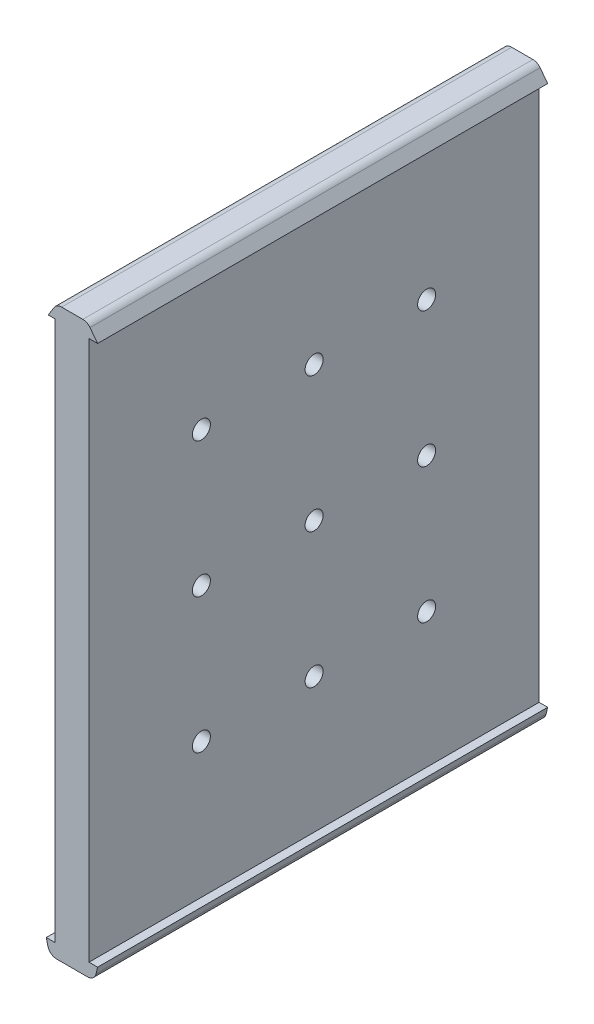
ISO-10303-21;
HEADER;
FILE_DESCRIPTION(('STEP AP214'),'2;1');
FILE_NAME('part.step','',(''),(''),'','','');
FILE_SCHEMA(('AUTOMOTIVE_DESIGN { 1 0 10303 214 1 1 1 1 }'));
ENDSEC;
DATA;
#1=APPLICATION_CONTEXT('core data for automotive mechanical design processes');
#2=APPLICATION_PROTOCOL_DEFINITION('international standard','automotive_design',2000,#1);
#3=PRODUCT_CONTEXT('',#1,'mechanical');
#4=PRODUCT('Part','Part','',(#3));
#5=PRODUCT_RELATED_PRODUCT_CATEGORY('part','',(#4));
#6=PRODUCT_DEFINITION_FORMATION('','',#4);
#7=PRODUCT_DEFINITION_CONTEXT('part definition',#1,'design');
#8=PRODUCT_DEFINITION('design','',#6,#7);
#9=PRODUCT_DEFINITION_SHAPE('','',#8);
#10=(LENGTH_UNIT() NAMED_UNIT(*) SI_UNIT(.MILLI.,.METRE.));
#11=(NAMED_UNIT(*) PLANE_ANGLE_UNIT() SI_UNIT($,.RADIAN.));
#12=(NAMED_UNIT(*) SI_UNIT($,.STERADIAN.) SOLID_ANGLE_UNIT());
#13=UNCERTAINTY_MEASURE_WITH_UNIT(LENGTH_MEASURE(1.E-05),#10,'distance_accuracy_value','');
#14=(GEOMETRIC_REPRESENTATION_CONTEXT(3) GLOBAL_UNCERTAINTY_ASSIGNED_CONTEXT((#13)) GLOBAL_UNIT_ASSIGNED_CONTEXT((#10,
#11,#12)) REPRESENTATION_CONTEXT('',''));
#15=CARTESIAN_POINT('',(0.,0.,0.));
#16=DIRECTION('',(0.,0.,1.));
#17=DIRECTION('',(1.,0.,0.));
#18=AXIS2_PLACEMENT_3D('',#15,#16,#17);
#19=CARTESIAN_POINT('',(-7.17106379094956E-13,-98.178624658982,160.));
#20=DIRECTION('',(0.,1.,0.));
#21=DIRECTION('',(-1.,0.,0.));
#22=AXIS2_PLACEMENT_3D('',#19,#20,#21);
#23=PLANE('',#22);
#24=DIRECTION('',(1.,0.,0.));
#25=VECTOR('',#24,1.);
#26=CARTESIAN_POINT('',(-7.17106379094956E-13,-98.178624658982,30.));
#27=LINE('',#26,#25);
#28=CARTESIAN_POINT('',(-5.69999999999999,-98.178624658982,30.));
#29=VERTEX_POINT('',#28);
#30=CARTESIAN_POINT('',(-3.79999999999998,-98.178624658982,30.));
#31=VERTEX_POINT('',#30);
#32=EDGE_CURVE('E241',#29,#31,#27,.T.);
#33=ORIENTED_EDGE('',*,*,#32,.F.);
#34=DIRECTION('',(0.,0.,-1.));
#35=VECTOR('',#34,1.);
#36=CARTESIAN_POINT('',(-5.69999999999999,-98.178624658982,160.));
#37=LINE('',#36,#35);
#38=CARTESIAN_POINT('',(-5.69999999999999,-98.178624658982,130.));
#39=VERTEX_POINT('',#38);
#40=EDGE_CURVE('E208',#39,#29,#37,.T.);
#41=ORIENTED_EDGE('',*,*,#40,.F.);
#42=DIRECTION('',(-1.,0.,0.));
#43=VECTOR('',#42,1.);
#44=CARTESIAN_POINT('',(-7.17106379094956E-13,-98.178624658982,130.));
#45=LINE('',#44,#43);
#46=CARTESIAN_POINT('',(-3.8,-98.178624658982,130.));
#47=VERTEX_POINT('',#46);
#48=EDGE_CURVE('E260',#47,#39,#45,.T.);
#49=ORIENTED_EDGE('',*,*,#48,.F.);
#50=DIRECTION('',(0.,0.,-1.));
#51=VECTOR('',#50,1.);
#52=CARTESIAN_POINT('',(-3.79999999999998,-98.178624658982,160.));
#53=LINE('',#52,#51);
#54=EDGE_CURVE('E203',#47,#31,#53,.T.);
#55=ORIENTED_EDGE('',*,*,#54,.T.);
#56=EDGE_LOOP('',(#33,#41,#49,#55));
#57=FACE_BOUND('',#56,.T.);
#58=ADVANCED_FACE('F45',(#57),#23,.T.);
#59=CARTESIAN_POINT('',(0.,21.821375341018,160.));
#60=DIRECTION('',(0.,-1.,0.));
#61=DIRECTION('',(0.,0.,-1.));
#62=AXIS2_PLACEMENT_3D('',#59,#60,#61);
#63=PLANE('',#62);
#64=DIRECTION('',(-1.,0.,0.));
#65=VECTOR('',#64,1.);
#66=CARTESIAN_POINT('',(0.,21.821375341018,30.));
#67=LINE('',#66,#65);
#68=CARTESIAN_POINT('',(5.70000000000001,21.821375341018,30.));
#69=VERTEX_POINT('',#68);
#70=CARTESIAN_POINT('',(3.8,21.821375341018,30.));
#71=VERTEX_POINT('',#70);
#72=EDGE_CURVE('E383',#69,#71,#67,.T.);
#73=ORIENTED_EDGE('',*,*,#72,.F.);
#74=DIRECTION('',(0.,0.,-1.));
#75=VECTOR('',#74,1.);
#76=CARTESIAN_POINT('',(5.70000000000001,21.821375341018,160.));
#77=LINE('',#76,#75);
#78=CARTESIAN_POINT('',(5.70000000000001,21.821375341018,130.));
#79=VERTEX_POINT('',#78);
#80=EDGE_CURVE('E185',#79,#69,#77,.T.);
#81=ORIENTED_EDGE('',*,*,#80,.F.);
#82=DIRECTION('',(1.,0.,0.));
#83=VECTOR('',#82,1.);
#84=CARTESIAN_POINT('',(0.,21.821375341018,130.));
#85=LINE('',#84,#83);
#86=CARTESIAN_POINT('',(3.8,21.821375341018,130.));
#87=VERTEX_POINT('',#86);
#88=EDGE_CURVE('E266',#87,#79,#85,.T.);
#89=ORIENTED_EDGE('',*,*,#88,.F.);
#90=DIRECTION('',(0.,0.,-1.));
#91=VECTOR('',#90,1.);
#92=CARTESIAN_POINT('',(3.8,21.821375341018,160.));
#93=LINE('',#92,#91);
#94=EDGE_CURVE('E188',#87,#71,#93,.T.);
#95=ORIENTED_EDGE('',*,*,#94,.T.);
#96=EDGE_LOOP('',(#73,#81,#89,#95));
#97=FACE_BOUND('',#96,.T.);
#98=ADVANCED_FACE('F381',(#97),#63,.T.);
#99=CARTESIAN_POINT('',(-3.8,0.,160.));
#100=DIRECTION('',(-1.,0.,0.));
#101=DIRECTION('',(0.,-1.,0.));
#102=AXIS2_PLACEMENT_3D('',#99,#100,#101);
#103=PLANE('',#102);
#104=CARTESIAN_POINT('',(-3.79999999999999,-38.178624658982,105.042568922673));
#105=DIRECTION('',(-1.,0.,0.));
#106=DIRECTION('',(0.,-1.,0.));
#107=AXIS2_PLACEMENT_3D('',#104,#105,#106);
#108=CIRCLE('',#107,2.);
#109=CARTESIAN_POINT('',(-3.79999999999999,-40.178624658982,105.042568922673));
#110=VERTEX_POINT('',#109);
#111=EDGE_CURVE('E284',#110,#110,#108,.F.);
#112=ORIENTED_EDGE('',*,*,#111,.T.);
#113=EDGE_LOOP('',(#112));
#114=FACE_BOUND('',#113,.T.);
#115=CARTESIAN_POINT('',(-3.79999999999999,-8.17862465898205,55.));
#116=DIRECTION('',(-1.,0.,0.));
#117=DIRECTION('',(0.,-1.,0.));
#118=AXIS2_PLACEMENT_3D('',#115,#116,#117);
#119=CIRCLE('',#118,2.);
#120=CARTESIAN_POINT('',(-3.79999999999999,-10.178624658982,55.));
#121=VERTEX_POINT('',#120);
#122=EDGE_CURVE('E296',#121,#121,#119,.F.);
#123=ORIENTED_EDGE('',*,*,#122,.T.);
#124=EDGE_LOOP('',(#123));
#125=FACE_BOUND('',#124,.T.);
#126=CARTESIAN_POINT('',(-3.79999999999999,-68.178624658982,55.));
#127=DIRECTION('',(-1.,0.,0.));
#128=DIRECTION('',(0.,-1.,0.));
#129=AXIS2_PLACEMENT_3D('',#126,#127,#128);
#130=CIRCLE('',#129,2.);
#131=CARTESIAN_POINT('',(-3.79999999999999,-70.178624658982,55.));
#132=VERTEX_POINT('',#131);
#133=EDGE_CURVE('E308',#132,#132,#130,.F.);
#134=ORIENTED_EDGE('',*,*,#133,.T.);
#135=EDGE_LOOP('',(#134));
#136=FACE_BOUND('',#135,.T.);
#137=CARTESIAN_POINT('',(-3.79999999999999,-8.17862465898205,80.));
#138=DIRECTION('',(-1.,0.,0.));
#139=DIRECTION('',(0.,-1.,0.));
#140=AXIS2_PLACEMENT_3D('',#137,#138,#139);
#141=CIRCLE('',#140,2.);
#142=CARTESIAN_POINT('',(-3.79999999999999,-10.178624658982,80.));
#143=VERTEX_POINT('',#142);
#144=EDGE_CURVE('E320',#143,#143,#141,.F.);
#145=ORIENTED_EDGE('',*,*,#144,.T.);
#146=EDGE_LOOP('',(#145));
#147=FACE_BOUND('',#146,.T.);
#148=DIRECTION('',(0.,-1.,0.));
#149=VECTOR('',#148,1.);
#150=CARTESIAN_POINT('',(-3.8,21.821375341018,130.));
#151=LINE('',#150,#149);
#152=CARTESIAN_POINT('',(-3.8,21.821375341018,130.));
#153=VERTEX_POINT('',#152);
#154=EDGE_CURVE('E330',#153,#47,#151,.T.);
#155=ORIENTED_EDGE('',*,*,#154,.F.);
#156=DIRECTION('',(0.,0.,-1.));
#157=VECTOR('',#156,1.);
#158=CARTESIAN_POINT('',(-3.8,21.821375341018,160.));
#159=LINE('',#158,#157);
#160=CARTESIAN_POINT('',(-3.8,21.821375341018,30.));
#161=VERTEX_POINT('',#160);
#162=EDGE_CURVE('E200',#153,#161,#159,.T.);
#163=ORIENTED_EDGE('',*,*,#162,.T.);
#164=DIRECTION('',(0.,-1.,0.));
#165=VECTOR('',#164,1.);
#166=CARTESIAN_POINT('',(-3.8,21.821375341018,30.));
#167=LINE('',#166,#165);
#168=EDGE_CURVE('E333',#161,#31,#167,.T.);
#169=ORIENTED_EDGE('',*,*,#168,.T.);
#170=ORIENTED_EDGE('',*,*,#54,.F.);
#171=EDGE_LOOP('',(#155,#163,#169,#170));
#172=FACE_BOUND('',#171,.T.);
#173=CARTESIAN_POINT('',(-3.79999999999999,-38.178624658982,80.));
#174=DIRECTION('',(-1.,0.,0.));
#175=DIRECTION('',(0.,-1.,0.));
#176=AXIS2_PLACEMENT_3D('',#173,#174,#175);
#177=CIRCLE('',#176,2.);
#178=CARTESIAN_POINT('',(-3.79999999999999,-40.178624658982,80.));
#179=VERTEX_POINT('',#178);
#180=EDGE_CURVE('E326',#179,#179,#177,.F.);
#181=ORIENTED_EDGE('',*,*,#180,.T.);
#182=EDGE_LOOP('',(#181));
#183=FACE_BOUND('',#182,.T.);
#184=CARTESIAN_POINT('',(-3.79999999999999,-68.178624658982,80.));
#185=DIRECTION('',(-1.,0.,0.));
#186=DIRECTION('',(0.,-1.,0.));
#187=AXIS2_PLACEMENT_3D('',#184,#185,#186);
#188=CIRCLE('',#187,2.);
#189=CARTESIAN_POINT('',(-3.79999999999999,-70.178624658982,80.));
#190=VERTEX_POINT('',#189);
#191=EDGE_CURVE('E314',#190,#190,#188,.F.);
#192=ORIENTED_EDGE('',*,*,#191,.T.);
#193=EDGE_LOOP('',(#192));
#194=FACE_BOUND('',#193,.T.);
#195=CARTESIAN_POINT('',(-3.79999999999999,-38.178624658982,55.));
#196=DIRECTION('',(-1.,0.,0.));
#197=DIRECTION('',(0.,-1.,0.));
#198=AXIS2_PLACEMENT_3D('',#195,#196,#197);
#199=CIRCLE('',#198,2.);
#200=CARTESIAN_POINT('',(-3.79999999999999,-40.178624658982,55.));
#201=VERTEX_POINT('',#200);
#202=EDGE_CURVE('E302',#201,#201,#199,.F.);
#203=ORIENTED_EDGE('',*,*,#202,.T.);
#204=EDGE_LOOP('',(#203));
#205=FACE_BOUND('',#204,.T.);
#206=CARTESIAN_POINT('',(-3.79999999999999,-68.178624658982,105.042568922673));
#207=DIRECTION('',(-1.,0.,0.));
#208=DIRECTION('',(0.,-1.,0.));
#209=AXIS2_PLACEMENT_3D('',#206,#207,#208);
#210=CIRCLE('',#209,2.);
#211=CARTESIAN_POINT('',(-3.79999999999999,-70.178624658982,105.042568922673));
#212=VERTEX_POINT('',#211);
#213=EDGE_CURVE('E290',#212,#212,#210,.F.);
#214=ORIENTED_EDGE('',*,*,#213,.T.);
#215=EDGE_LOOP('',(#214));
#216=FACE_BOUND('',#215,.T.);
#217=CARTESIAN_POINT('',(-3.79999999999999,-8.17862465898205,105.042568922673));
#218=DIRECTION('',(-1.,0.,0.));
#219=DIRECTION('',(0.,-1.,0.));
#220=AXIS2_PLACEMENT_3D('',#217,#218,#219);
#221=CIRCLE('',#220,2.);
#222=CARTESIAN_POINT('',(-3.79999999999999,-10.178624658982,105.042568922673));
#223=VERTEX_POINT('',#222);
#224=EDGE_CURVE('E278',#223,#223,#221,.F.);
#225=ORIENTED_EDGE('',*,*,#224,.T.);
#226=EDGE_LOOP('',(#225));
#227=FACE_BOUND('',#226,.T.);
#228=ADVANCED_FACE('F47',(#114,#125,#136,#147,#172,#183,#194,#205,#216,#227),#103,.T.);
#229=CARTESIAN_POINT('',(3.8,0.,160.));
#230=DIRECTION('',(-1.,0.,0.));
#231=DIRECTION('',(0.,-1.,0.));
#232=AXIS2_PLACEMENT_3D('',#229,#230,#231);
#233=PLANE('',#232);
#234=CARTESIAN_POINT('',(3.80000000000001,-38.178624658982,105.042568922673));
#235=DIRECTION('',(1.,0.,0.));
#236=DIRECTION('',(0.,0.,-1.));
#237=AXIS2_PLACEMENT_3D('',#234,#235,#236);
#238=CIRCLE('',#237,2.);
#239=CARTESIAN_POINT('',(3.80000000000001,-38.178624658982,103.042568922673));
#240=VERTEX_POINT('',#239);
#241=EDGE_CURVE('E281',#240,#240,#238,.T.);
#242=ORIENTED_EDGE('',*,*,#241,.F.);
#243=EDGE_LOOP('',(#242));
#244=FACE_BOUND('',#243,.T.);
#245=CARTESIAN_POINT('',(3.8,-8.17862465898205,55.));
#246=DIRECTION('',(1.,0.,0.));
#247=DIRECTION('',(0.,0.,-1.));
#248=AXIS2_PLACEMENT_3D('',#245,#246,#247);
#249=CIRCLE('',#248,2.);
#250=CARTESIAN_POINT('',(3.8,-8.17862465898205,53.));
#251=VERTEX_POINT('',#250);
#252=EDGE_CURVE('E293',#251,#251,#249,.T.);
#253=ORIENTED_EDGE('',*,*,#252,.F.);
#254=EDGE_LOOP('',(#253));
#255=FACE_BOUND('',#254,.T.);
#256=CARTESIAN_POINT('',(3.80000000000002,-68.178624658982,55.));
#257=DIRECTION('',(1.,0.,0.));
#258=DIRECTION('',(0.,0.,-1.));
#259=AXIS2_PLACEMENT_3D('',#256,#257,#258);
#260=CIRCLE('',#259,2.);
#261=CARTESIAN_POINT('',(3.80000000000002,-68.178624658982,53.));
#262=VERTEX_POINT('',#261);
#263=EDGE_CURVE('E305',#262,#262,#260,.T.);
#264=ORIENTED_EDGE('',*,*,#263,.F.);
#265=EDGE_LOOP('',(#264));
#266=FACE_BOUND('',#265,.T.);
#267=CARTESIAN_POINT('',(3.8,-8.17862465898205,80.));
#268=DIRECTION('',(1.,0.,0.));
#269=DIRECTION('',(0.,0.,-1.));
#270=AXIS2_PLACEMENT_3D('',#267,#268,#269);
#271=CIRCLE('',#270,2.);
#272=CARTESIAN_POINT('',(3.8,-8.17862465898205,78.));
#273=VERTEX_POINT('',#272);
#274=EDGE_CURVE('E317',#273,#273,#271,.T.);
#275=ORIENTED_EDGE('',*,*,#274,.F.);
#276=EDGE_LOOP('',(#275));
#277=FACE_BOUND('',#276,.T.);
#278=ORIENTED_EDGE('',*,*,#94,.F.);
#279=DIRECTION('',(0.,1.,0.));
#280=VECTOR('',#279,1.);
#281=CARTESIAN_POINT('',(3.80000000000002,21.821375341018,130.));
#282=LINE('',#281,#280);
#283=CARTESIAN_POINT('',(3.80000000000002,-98.178624658982,130.));
#284=VERTEX_POINT('',#283);
#285=EDGE_CURVE('E329',#284,#87,#282,.T.);
#286=ORIENTED_EDGE('',*,*,#285,.F.);
#287=DIRECTION('',(0.,0.,-1.));
#288=VECTOR('',#287,1.);
#289=CARTESIAN_POINT('',(3.80000000000002,-98.178624658982,160.));
#290=LINE('',#289,#288);
#291=CARTESIAN_POINT('',(3.80000000000002,-98.178624658982,30.));
#292=VERTEX_POINT('',#291);
#293=EDGE_CURVE('E197',#284,#292,#290,.T.);
#294=ORIENTED_EDGE('',*,*,#293,.T.);
#295=DIRECTION('',(0.,1.,0.));
#296=VECTOR('',#295,1.);
#297=CARTESIAN_POINT('',(3.80000000000002,21.821375341018,30.));
#298=LINE('',#297,#296);
#299=EDGE_CURVE('E342',#292,#71,#298,.T.);
#300=ORIENTED_EDGE('',*,*,#299,.T.);
#301=EDGE_LOOP('',(#278,#286,#294,#300));
#302=FACE_BOUND('',#301,.T.);
#303=CARTESIAN_POINT('',(3.80000000000001,-38.178624658982,80.));
#304=DIRECTION('',(1.,0.,0.));
#305=DIRECTION('',(0.,0.,-1.));
#306=AXIS2_PLACEMENT_3D('',#303,#304,#305);
#307=CIRCLE('',#306,2.);
#308=CARTESIAN_POINT('',(3.80000000000001,-38.178624658982,78.));
#309=VERTEX_POINT('',#308);
#310=EDGE_CURVE('E323',#309,#309,#307,.T.);
#311=ORIENTED_EDGE('',*,*,#310,.F.);
#312=EDGE_LOOP('',(#311));
#313=FACE_BOUND('',#312,.T.);
#314=CARTESIAN_POINT('',(3.80000000000002,-68.178624658982,80.));
#315=DIRECTION('',(1.,0.,0.));
#316=DIRECTION('',(0.,0.,-1.));
#317=AXIS2_PLACEMENT_3D('',#314,#315,#316);
#318=CIRCLE('',#317,2.);
#319=CARTESIAN_POINT('',(3.80000000000002,-68.178624658982,78.));
#320=VERTEX_POINT('',#319);
#321=EDGE_CURVE('E311',#320,#320,#318,.T.);
#322=ORIENTED_EDGE('',*,*,#321,.F.);
#323=EDGE_LOOP('',(#322));
#324=FACE_BOUND('',#323,.T.);
#325=CARTESIAN_POINT('',(3.80000000000001,-38.178624658982,55.));
#326=DIRECTION('',(1.,0.,0.));
#327=DIRECTION('',(0.,0.,-1.));
#328=AXIS2_PLACEMENT_3D('',#325,#326,#327);
#329=CIRCLE('',#328,2.);
#330=CARTESIAN_POINT('',(3.80000000000001,-38.178624658982,53.));
#331=VERTEX_POINT('',#330);
#332=EDGE_CURVE('E299',#331,#331,#329,.T.);
#333=ORIENTED_EDGE('',*,*,#332,.F.);
#334=EDGE_LOOP('',(#333));
#335=FACE_BOUND('',#334,.T.);
#336=CARTESIAN_POINT('',(3.80000000000002,-68.178624658982,105.042568922673));
#337=DIRECTION('',(1.,0.,0.));
#338=DIRECTION('',(0.,0.,-1.));
#339=AXIS2_PLACEMENT_3D('',#336,#337,#338);
#340=CIRCLE('',#339,2.);
#341=CARTESIAN_POINT('',(3.80000000000002,-68.178624658982,103.042568922673));
#342=VERTEX_POINT('',#341);
#343=EDGE_CURVE('E287',#342,#342,#340,.T.);
#344=ORIENTED_EDGE('',*,*,#343,.F.);
#345=EDGE_LOOP('',(#344));
#346=FACE_BOUND('',#345,.T.);
#347=CARTESIAN_POINT('',(3.8,-8.17862465898205,105.042568922673));
#348=DIRECTION('',(1.,0.,0.));
#349=DIRECTION('',(0.,0.,-1.));
#350=AXIS2_PLACEMENT_3D('',#347,#348,#349);
#351=CIRCLE('',#350,2.);
#352=CARTESIAN_POINT('',(3.8,-8.17862465898205,103.042568922673));
#353=VERTEX_POINT('',#352);
#354=EDGE_CURVE('E275',#353,#353,#351,.T.);
#355=ORIENTED_EDGE('',*,*,#354,.F.);
#356=EDGE_LOOP('',(#355));
#357=FACE_BOUND('',#356,.T.);
#358=ADVANCED_FACE('F376',(#244,#255,#266,#277,#302,#313,#324,#335,#346,#357),#233,.F.);
#359=CARTESIAN_POINT('',(-27.1312025062026,-6.33061391811397,160.));
#360=DIRECTION('',(-0.973841209741793,-0.227229615606419,0.));
#361=DIRECTION('',(0.227229615606419,-0.973841209741793,0.));
#362=AXIS2_PLACEMENT_3D('',#359,#360,#361);
#363=PLANE('',#362);
#364=DIRECTION('',(-0.227229615606419,0.973841209741793,0.));
#365=VECTOR('',#364,1.);
#366=CARTESIAN_POINT('',(-27.1312025062026,-6.33061391811397,30.));
#367=LINE('',#366,#365);
#368=CARTESIAN_POINT('',(-5.36062617938365,-99.6330838901949,30.));
#369=VERTEX_POINT('',#368);
#370=EDGE_CURVE('E253',#369,#29,#367,.T.);
#371=ORIENTED_EDGE('',*,*,#370,.F.);
#372=DIRECTION('',(0.,0.,-1.));
#373=VECTOR('',#372,1.);
#374=CARTESIAN_POINT('',(-5.36062617938366,-99.6330838901949,160.));
#375=LINE('',#374,#373);
#376=CARTESIAN_POINT('',(-5.36062617938366,-99.6330838901949,130.));
#377=VERTEX_POINT('',#376);
#378=EDGE_CURVE('E213',#377,#369,#375,.T.);
#379=ORIENTED_EDGE('',*,*,#378,.F.);
#380=DIRECTION('',(0.227229615606419,-0.973841209741793,0.));
#381=VECTOR('',#380,1.);
#382=CARTESIAN_POINT('',(-27.1312025062026,-6.33061391811397,130.));
#383=LINE('',#382,#381);
#384=EDGE_CURVE('E361',#39,#377,#383,.T.);
#385=ORIENTED_EDGE('',*,*,#384,.F.);
#386=ORIENTED_EDGE('',*,*,#40,.T.);
#387=EDGE_LOOP('',(#371,#379,#385,#386));
#388=FACE_BOUND('',#387,.T.);
#389=ADVANCED_FACE('F429',(#388),#363,.T.);
#390=CARTESIAN_POINT('',(-3.41294375990007,-99.178624658982,160.));
#391=DIRECTION('',(0.,0.,-1.));
#392=DIRECTION('',(-1.,0.,0.));
#393=AXIS2_PLACEMENT_3D('',#390,#391,#392);
#394=CYLINDRICAL_SURFACE('',#393,2.);
#395=ORIENTED_EDGE('',*,*,#378,.T.);
#396=CARTESIAN_POINT('',(-3.41294375990007,-99.178624658982,30.));
#397=DIRECTION('',(0.,0.,1.));
#398=DIRECTION('',(1.,0.,0.));
#399=AXIS2_PLACEMENT_3D('',#396,#397,#398);
#400=CIRCLE('',#399,2.);
#401=CARTESIAN_POINT('',(-3.41294375990007,-101.178624658982,30.));
#402=VERTEX_POINT('',#401);
#403=EDGE_CURVE('E250',#369,#402,#400,.T.);
#404=ORIENTED_EDGE('',*,*,#403,.T.);
#405=DIRECTION('',(0.,0.,-1.));
#406=VECTOR('',#405,1.);
#407=CARTESIAN_POINT('',(-3.41294375990007,-101.178624658982,160.));
#408=LINE('',#407,#406);
#409=CARTESIAN_POINT('',(-3.41294375990007,-101.178624658982,130.));
#410=VERTEX_POINT('',#409);
#411=EDGE_CURVE('E216',#410,#402,#408,.T.);
#412=ORIENTED_EDGE('',*,*,#411,.F.);
#413=CARTESIAN_POINT('',(-3.41294375990007,-99.178624658982,130.));
#414=DIRECTION('',(0.,0.,-1.));
#415=DIRECTION('',(-1.,0.,0.));
#416=AXIS2_PLACEMENT_3D('',#413,#414,#415);
#417=CIRCLE('',#416,2.);
#418=EDGE_CURVE('E362',#410,#377,#417,.T.);
#419=ORIENTED_EDGE('',*,*,#418,.T.);
#420=EDGE_LOOP('',(#395,#404,#412,#419));
#421=FACE_BOUND('',#420,.T.);
#422=ADVANCED_FACE('F426',(#421),#394,.T.);
#423=CARTESIAN_POINT('',(0.,-101.178624658982,160.));
#424=DIRECTION('',(0.,1.,0.));
#425=DIRECTION('',(0.,0.,1.));
#426=AXIS2_PLACEMENT_3D('',#423,#424,#425);
#427=PLANE('',#426);
#428=ORIENTED_EDGE('',*,*,#411,.T.);
#429=DIRECTION('',(1.,0.,0.));
#430=VECTOR('',#429,1.);
#431=CARTESIAN_POINT('',(0.,-101.178624658982,30.));
#432=LINE('',#431,#430);
#433=CARTESIAN_POINT('',(3.4129437599001,-101.178624658982,30.));
#434=VERTEX_POINT('',#433);
#435=EDGE_CURVE('E243',#402,#434,#432,.T.);
#436=ORIENTED_EDGE('',*,*,#435,.T.);
#437=DIRECTION('',(0.,0.,-1.));
#438=VECTOR('',#437,1.);
#439=CARTESIAN_POINT('',(3.4129437599001,-101.178624658982,160.));
#440=LINE('',#439,#438);
#441=CARTESIAN_POINT('',(3.4129437599001,-101.178624658982,130.));
#442=VERTEX_POINT('',#441);
#443=EDGE_CURVE('E219',#442,#434,#440,.T.);
#444=ORIENTED_EDGE('',*,*,#443,.F.);
#445=DIRECTION('',(-1.,0.,0.));
#446=VECTOR('',#445,1.);
#447=CARTESIAN_POINT('',(0.,-101.178624658982,130.));
#448=LINE('',#447,#446);
#449=EDGE_CURVE('E365',#442,#410,#448,.T.);
#450=ORIENTED_EDGE('',*,*,#449,.T.);
#451=EDGE_LOOP('',(#428,#436,#444,#450));
#452=FACE_BOUND('',#451,.T.);
#453=ADVANCED_FACE('F420',(#452),#427,.F.);
#454=CARTESIAN_POINT('',(3.4129437599001,-99.178624658982,160.));
#455=DIRECTION('',(0.,0.,-1.));
#456=DIRECTION('',(-1.,0.,0.));
#457=AXIS2_PLACEMENT_3D('',#454,#455,#456);
#458=CYLINDRICAL_SURFACE('',#457,2.);
#459=ORIENTED_EDGE('',*,*,#443,.T.);
#460=CARTESIAN_POINT('',(3.4129437599001,-99.178624658982,30.));
#461=DIRECTION('',(0.,0.,1.));
#462=DIRECTION('',(1.,0.,0.));
#463=AXIS2_PLACEMENT_3D('',#460,#461,#462);
#464=CIRCLE('',#463,2.);
#465=CARTESIAN_POINT('',(5.3606261793837,-99.6330838901949,30.));
#466=VERTEX_POINT('',#465);
#467=EDGE_CURVE('E240',#434,#466,#464,.T.);
#468=ORIENTED_EDGE('',*,*,#467,.T.);
#469=DIRECTION('',(0.,0.,-1.));
#470=VECTOR('',#469,1.);
#471=CARTESIAN_POINT('',(5.3606261793837,-99.6330838901949,160.));
#472=LINE('',#471,#470);
#473=CARTESIAN_POINT('',(5.36062617938369,-99.6330838901949,130.));
#474=VERTEX_POINT('',#473);
#475=EDGE_CURVE('E222',#474,#466,#472,.T.);
#476=ORIENTED_EDGE('',*,*,#475,.F.);
#477=CARTESIAN_POINT('',(3.4129437599001,-99.178624658982,130.));
#478=DIRECTION('',(0.,0.,-1.));
#479=DIRECTION('',(-1.,0.,0.));
#480=AXIS2_PLACEMENT_3D('',#477,#478,#479);
#481=CIRCLE('',#480,2.);
#482=EDGE_CURVE('E371',#474,#442,#481,.T.);
#483=ORIENTED_EDGE('',*,*,#482,.T.);
#484=EDGE_LOOP('',(#459,#468,#476,#483));
#485=FACE_BOUND('',#484,.T.);
#486=ADVANCED_FACE('F416',(#485),#458,.T.);
#487=CARTESIAN_POINT('',(27.1312025062019,-6.33061391811356,160.));
#488=DIRECTION('',(0.973841209741795,-0.227229615606411,0.));
#489=DIRECTION('',(0.227229615606411,0.973841209741795,0.));
#490=AXIS2_PLACEMENT_3D('',#487,#488,#489);
#491=PLANE('',#490);
#492=DIRECTION('',(-0.227229615606411,-0.973841209741795,0.));
#493=VECTOR('',#492,1.);
#494=CARTESIAN_POINT('',(27.1312025062019,-6.33061391811356,30.));
#495=LINE('',#494,#493);
#496=CARTESIAN_POINT('',(5.70000000000001,-98.1786246589821,30.));
#497=VERTEX_POINT('',#496);
#498=EDGE_CURVE('E238',#497,#466,#495,.T.);
#499=ORIENTED_EDGE('',*,*,#498,.F.);
#500=DIRECTION('',(0.,0.,-1.));
#501=VECTOR('',#500,1.);
#502=CARTESIAN_POINT('',(5.70000000000001,-98.1786246589821,160.));
#503=LINE('',#502,#501);
#504=CARTESIAN_POINT('',(5.70000000000001,-98.1786246589821,130.));
#505=VERTEX_POINT('',#504);
#506=EDGE_CURVE('E206',#505,#497,#503,.T.);
#507=ORIENTED_EDGE('',*,*,#506,.F.);
#508=DIRECTION('',(0.227229615606411,0.973841209741795,0.));
#509=VECTOR('',#508,1.);
#510=CARTESIAN_POINT('',(27.1312025062019,-6.33061391811356,130.));
#511=LINE('',#510,#509);
#512=EDGE_CURVE('E236',#474,#505,#511,.T.);
#513=ORIENTED_EDGE('',*,*,#512,.F.);
#514=ORIENTED_EDGE('',*,*,#475,.T.);
#515=EDGE_LOOP('',(#499,#507,#513,#514));
#516=FACE_BOUND('',#515,.T.);
#517=ADVANCED_FACE('F235',(#516),#491,.T.);
#518=EDGE_CURVE('E230',#292,#497,#27,.T.);
#519=ORIENTED_EDGE('',*,*,#518,.F.);
#520=ORIENTED_EDGE('',*,*,#293,.F.);
#521=EDGE_CURVE('E231',#505,#284,#45,.T.);
#522=ORIENTED_EDGE('',*,*,#521,.F.);
#523=ORIENTED_EDGE('',*,*,#506,.T.);
#524=EDGE_LOOP('',(#519,#520,#522,#523));
#525=FACE_BOUND('',#524,.T.);
#526=ADVANCED_FACE('F228',(#525),#23,.T.);
#527=CARTESIAN_POINT('',(-5.26679924331625,21.821375341018,30.));
#528=VERTEX_POINT('',#527);
#529=EDGE_CURVE('E60',#161,#528,#67,.T.);
#530=ORIENTED_EDGE('',*,*,#529,.F.);
#531=ORIENTED_EDGE('',*,*,#162,.F.);
#532=CARTESIAN_POINT('',(-5.26679924331625,21.821375341018,130.));
#533=VERTEX_POINT('',#532);
#534=EDGE_CURVE('E258',#533,#153,#85,.T.);
#535=ORIENTED_EDGE('',*,*,#534,.F.);
#536=DIRECTION('',(0.,0.,-1.));
#537=VECTOR('',#536,1.);
#538=CARTESIAN_POINT('',(-5.26679924331625,21.821375341018,160.));
#539=LINE('',#538,#537);
#540=EDGE_CURVE('E179',#533,#528,#539,.T.);
#541=ORIENTED_EDGE('',*,*,#540,.T.);
#542=EDGE_LOOP('',(#530,#531,#535,#541));
#543=FACE_BOUND('',#542,.T.);
#544=ADVANCED_FACE('F348',(#543),#63,.T.);
#545=CARTESIAN_POINT('',(14.1258813531818,10.7688950319018,160.));
#546=DIRECTION('',(-0.795260200775992,-0.606268268229279,0.));
#547=DIRECTION('',(0.606268268229279,-0.795260200775992,0.));
#548=AXIS2_PLACEMENT_3D('',#545,#546,#547);
#549=PLANE('',#548);
#550=ORIENTED_EDGE('',*,*,#80,.T.);
#551=DIRECTION('',(-0.606268268229279,0.795260200775992,0.));
#552=VECTOR('',#551,1.);
#553=CARTESIAN_POINT('',(14.1258813531818,10.7688950319018,30.));
#554=LINE('',#553,#552);
#555=CARTESIAN_POINT('',(4.01326816928115,24.0339118774765,30.));
#556=VERTEX_POINT('',#555);
#557=EDGE_CURVE('E389',#69,#556,#554,.T.);
#558=ORIENTED_EDGE('',*,*,#557,.T.);
#559=DIRECTION('',(0.,0.,-1.));
#560=VECTOR('',#559,1.);
#561=CARTESIAN_POINT('',(4.01326816928115,24.0339118774765,160.));
#562=LINE('',#561,#560);
#563=CARTESIAN_POINT('',(4.01326816928115,24.0339118774765,130.));
#564=VERTEX_POINT('',#563);
#565=EDGE_CURVE('E177',#564,#556,#562,.T.);
#566=ORIENTED_EDGE('',*,*,#565,.F.);
#567=DIRECTION('',(0.606268268229279,-0.795260200775992,0.));
#568=VECTOR('',#567,1.);
#569=CARTESIAN_POINT('',(14.1258813531818,10.7688950319018,130.));
#570=LINE('',#569,#568);
#571=EDGE_CURVE('E269',#564,#79,#570,.T.);
#572=ORIENTED_EDGE('',*,*,#571,.T.);
#573=EDGE_LOOP('',(#550,#558,#566,#572));
#574=FACE_BOUND('',#573,.T.);
#575=ADVANCED_FACE('F387',(#574),#549,.F.);
#576=CARTESIAN_POINT('',(2.42274776772917,22.8213753410179,160.));
#577=DIRECTION('',(0.,0.,-1.));
#578=DIRECTION('',(-1.,0.,0.));
#579=AXIS2_PLACEMENT_3D('',#576,#577,#578);
#580=CYLINDRICAL_SURFACE('',#579,2.);
#581=CARTESIAN_POINT('',(2.42274776772917,22.8213753410179,30.));
#582=DIRECTION('',(0.,0.,1.));
#583=DIRECTION('',(1.,0.,0.));
#584=AXIS2_PLACEMENT_3D('',#581,#582,#583);
#585=CIRCLE('',#584,2.);
#586=CARTESIAN_POINT('',(2.42274776772917,24.821375341018,30.));
#587=VERTEX_POINT('',#586);
#588=EDGE_CURVE('E392',#587,#556,#585,.F.);
#589=ORIENTED_EDGE('',*,*,#588,.F.);
#590=DIRECTION('',(0.,0.,-1.));
#591=VECTOR('',#590,1.);
#592=CARTESIAN_POINT('',(2.42274776772917,24.821375341018,160.));
#593=LINE('',#592,#591);
#594=CARTESIAN_POINT('',(2.42274776772917,24.821375341018,130.));
#595=VERTEX_POINT('',#594);
#596=EDGE_CURVE('E172',#595,#587,#593,.T.);
#597=ORIENTED_EDGE('',*,*,#596,.F.);
#598=CARTESIAN_POINT('',(2.42274776772917,22.8213753410179,130.));
#599=DIRECTION('',(0.,0.,-1.));
#600=DIRECTION('',(-1.,0.,0.));
#601=AXIS2_PLACEMENT_3D('',#598,#599,#600);
#602=CIRCLE('',#601,2.);
#603=EDGE_CURVE('E273',#564,#595,#602,.F.);
#604=ORIENTED_EDGE('',*,*,#603,.F.);
#605=ORIENTED_EDGE('',*,*,#565,.T.);
#606=EDGE_LOOP('',(#589,#597,#604,#605));
#607=FACE_BOUND('',#606,.T.);
#608=ADVANCED_FACE('F391',(#607),#580,.T.);
#609=CARTESIAN_POINT('',(0.,24.821375341018,160.));
#610=DIRECTION('',(0.,-1.,0.));
#611=DIRECTION('',(1.,0.,0.));
#612=AXIS2_PLACEMENT_3D('',#609,#610,#611);
#613=PLANE('',#612);
#614=ORIENTED_EDGE('',*,*,#596,.T.);
#615=DIRECTION('',(1.,0.,0.));
#616=VECTOR('',#615,1.);
#617=CARTESIAN_POINT('',(-22.,24.821375341018,30.));
#618=LINE('',#617,#616);
#619=CARTESIAN_POINT('',(-2.29779279131514,24.821375341018,30.));
#620=VERTEX_POINT('',#619);
#621=EDGE_CURVE('E158',#620,#587,#618,.T.);
#622=ORIENTED_EDGE('',*,*,#621,.F.);
#623=DIRECTION('',(0.,0.,-1.));
#624=VECTOR('',#623,1.);
#625=CARTESIAN_POINT('',(-2.29779279131514,24.821375341018,160.));
#626=LINE('',#625,#624);
#627=CARTESIAN_POINT('',(-2.29779279131514,24.821375341018,130.));
#628=VERTEX_POINT('',#627);
#629=EDGE_CURVE('E170',#628,#620,#626,.T.);
#630=ORIENTED_EDGE('',*,*,#629,.F.);
#631=DIRECTION('',(1.,0.,0.));
#632=VECTOR('',#631,1.);
#633=CARTESIAN_POINT('',(-22.,24.821375341018,130.));
#634=LINE('',#633,#632);
#635=EDGE_CURVE('E255',#628,#595,#634,.T.);
#636=ORIENTED_EDGE('',*,*,#635,.T.);
#637=EDGE_LOOP('',(#614,#622,#630,#636));
#638=FACE_BOUND('',#637,.T.);
#639=ADVANCED_FACE('F168',(#638),#613,.F.);
#640=CARTESIAN_POINT('',(-2.29779279131514,22.8213753410179,160.));
#641=DIRECTION('',(0.,0.,-1.));
#642=DIRECTION('',(-1.,0.,0.));
#643=AXIS2_PLACEMENT_3D('',#640,#641,#642);
#644=CYLINDRICAL_SURFACE('',#643,2.);
#645=ORIENTED_EDGE('',*,*,#629,.T.);
#646=CARTESIAN_POINT('',(-2.29779279131514,22.8213753410179,30.));
#647=DIRECTION('',(0.,0.,1.));
#648=DIRECTION('',(1.,0.,0.));
#649=AXIS2_PLACEMENT_3D('',#646,#647,#648);
#650=CIRCLE('',#649,2.);
#651=CARTESIAN_POINT('',(-3.99915691907052,23.8727364135269,30.));
#652=VERTEX_POINT('',#651);
#653=EDGE_CURVE('E155',#620,#652,#650,.T.);
#654=ORIENTED_EDGE('',*,*,#653,.T.);
#655=DIRECTION('',(0.,0.,-1.));
#656=VECTOR('',#655,1.);
#657=CARTESIAN_POINT('',(-3.99915691907052,23.8727364135269,160.));
#658=LINE('',#657,#656);
#659=CARTESIAN_POINT('',(-3.99915691907052,23.8727364135269,130.));
#660=VERTEX_POINT('',#659);
#661=EDGE_CURVE('E175',#660,#652,#658,.T.);
#662=ORIENTED_EDGE('',*,*,#661,.F.);
#663=CARTESIAN_POINT('',(-2.29779279131514,22.8213753410179,130.));
#664=DIRECTION('',(0.,0.,-1.));
#665=DIRECTION('',(-1.,0.,0.));
#666=AXIS2_PLACEMENT_3D('',#663,#664,#665);
#667=CIRCLE('',#666,2.);
#668=EDGE_CURVE('E67',#660,#628,#667,.T.);
#669=ORIENTED_EDGE('',*,*,#668,.T.);
#670=EDGE_LOOP('',(#645,#654,#662,#669));
#671=FACE_BOUND('',#670,.T.);
#672=ADVANCED_FACE('F174',(#671),#644,.T.);
#673=CARTESIAN_POINT('',(-13.5696072539082,8.38536360515385,160.));
#674=DIRECTION('',(0.850682063877688,-0.52568053625448,0.));
#675=DIRECTION('',(0.52568053625448,0.850682063877688,0.));
#676=AXIS2_PLACEMENT_3D('',#673,#674,#675);
#677=PLANE('',#676);
#678=ORIENTED_EDGE('',*,*,#661,.T.);
#679=DIRECTION('',(-0.52568053625448,-0.850682063877688,0.));
#680=VECTOR('',#679,1.);
#681=CARTESIAN_POINT('',(-13.5696072539082,8.38536360515385,30.));
#682=LINE('',#681,#680);
#683=EDGE_CURVE('E12',#652,#528,#682,.T.);
#684=ORIENTED_EDGE('',*,*,#683,.T.);
#685=ORIENTED_EDGE('',*,*,#540,.F.);
#686=DIRECTION('',(0.52568053625448,0.850682063877688,0.));
#687=VECTOR('',#686,1.);
#688=CARTESIAN_POINT('',(-13.5696072539082,8.38536360515385,130.));
#689=LINE('',#688,#687);
#690=EDGE_CURVE('E53',#533,#660,#689,.T.);
#691=ORIENTED_EDGE('',*,*,#690,.T.);
#692=EDGE_LOOP('',(#678,#684,#685,#691));
#693=FACE_BOUND('',#692,.T.);
#694=ADVANCED_FACE('F351',(#693),#677,.F.);
#695=CARTESIAN_POINT('',(0.,0.,30.));
#696=DIRECTION('',(0.,0.,1.));
#697=DIRECTION('',(1.,0.,0.));
#698=AXIS2_PLACEMENT_3D('',#695,#696,#697);
#699=PLANE('',#698);
#700=ORIENTED_EDGE('',*,*,#168,.F.);
#701=ORIENTED_EDGE('',*,*,#529,.T.);
#702=ORIENTED_EDGE('',*,*,#683,.F.);
#703=ORIENTED_EDGE('',*,*,#653,.F.);
#704=ORIENTED_EDGE('',*,*,#621,.T.);
#705=ORIENTED_EDGE('',*,*,#588,.T.);
#706=ORIENTED_EDGE('',*,*,#557,.F.);
#707=ORIENTED_EDGE('',*,*,#72,.T.);
#708=ORIENTED_EDGE('',*,*,#299,.F.);
#709=ORIENTED_EDGE('',*,*,#518,.T.);
#710=ORIENTED_EDGE('',*,*,#498,.T.);
#711=ORIENTED_EDGE('',*,*,#467,.F.);
#712=ORIENTED_EDGE('',*,*,#435,.F.);
#713=ORIENTED_EDGE('',*,*,#403,.F.);
#714=ORIENTED_EDGE('',*,*,#370,.T.);
#715=ORIENTED_EDGE('',*,*,#32,.T.);
#716=EDGE_LOOP('',(#700,#701,#702,#703,#704,#705,#706,#707,#708,#709,#710,#711,#712,#713,#714,#715));
#717=FACE_BOUND('',#716,.T.);
#718=ADVANCED_FACE('F157',(#717),#699,.F.);
#719=CARTESIAN_POINT('',(0.,0.,130.));
#720=DIRECTION('',(0.,0.,-1.));
#721=DIRECTION('',(-1.,0.,0.));
#722=AXIS2_PLACEMENT_3D('',#719,#720,#721);
#723=PLANE('',#722);
#724=ORIENTED_EDGE('',*,*,#154,.T.);
#725=ORIENTED_EDGE('',*,*,#48,.T.);
#726=ORIENTED_EDGE('',*,*,#384,.T.);
#727=ORIENTED_EDGE('',*,*,#418,.F.);
#728=ORIENTED_EDGE('',*,*,#449,.F.);
#729=ORIENTED_EDGE('',*,*,#482,.F.);
#730=ORIENTED_EDGE('',*,*,#512,.T.);
#731=ORIENTED_EDGE('',*,*,#521,.T.);
#732=ORIENTED_EDGE('',*,*,#285,.T.);
#733=ORIENTED_EDGE('',*,*,#88,.T.);
#734=ORIENTED_EDGE('',*,*,#571,.F.);
#735=ORIENTED_EDGE('',*,*,#603,.T.);
#736=ORIENTED_EDGE('',*,*,#635,.F.);
#737=ORIENTED_EDGE('',*,*,#668,.F.);
#738=ORIENTED_EDGE('',*,*,#690,.F.);
#739=ORIENTED_EDGE('',*,*,#534,.T.);
#740=EDGE_LOOP('',(#724,#725,#726,#727,#728,#729,#730,#731,#732,#733,#734,#735,#736,#737,#738,#739));
#741=FACE_BOUND('',#740,.T.);
#742=ADVANCED_FACE('F352',(#741),#723,.F.);
#743=CARTESIAN_POINT('',(3.80000000000001,-38.178624658982,80.));
#744=DIRECTION('',(-1.,0.,0.));
#745=DIRECTION('',(0.,-1.,0.));
#746=AXIS2_PLACEMENT_3D('',#743,#744,#745);
#747=CYLINDRICAL_SURFACE('',#746,2.);
#748=ORIENTED_EDGE('',*,*,#180,.F.);
#749=EDGE_LOOP('',(#748));
#750=FACE_BOUND('',#749,.T.);
#751=ORIENTED_EDGE('',*,*,#310,.T.);
#752=EDGE_LOOP('',(#751));
#753=FACE_BOUND('',#752,.T.);
#754=ADVANCED_FACE('F456',(#750,#753),#747,.F.);
#755=CARTESIAN_POINT('',(3.8,-8.17862465898205,80.));
#756=DIRECTION('',(-1.,0.,0.));
#757=DIRECTION('',(0.,-1.,0.));
#758=AXIS2_PLACEMENT_3D('',#755,#756,#757);
#759=CYLINDRICAL_SURFACE('',#758,2.);
#760=ORIENTED_EDGE('',*,*,#144,.F.);
#761=EDGE_LOOP('',(#760));
#762=FACE_BOUND('',#761,.T.);
#763=ORIENTED_EDGE('',*,*,#274,.T.);
#764=EDGE_LOOP('',(#763));
#765=FACE_BOUND('',#764,.T.);
#766=ADVANCED_FACE('F453',(#762,#765),#759,.F.);
#767=CARTESIAN_POINT('',(3.80000000000002,-68.178624658982,80.));
#768=DIRECTION('',(-1.,0.,0.));
#769=DIRECTION('',(0.,-1.,0.));
#770=AXIS2_PLACEMENT_3D('',#767,#768,#769);
#771=CYLINDRICAL_SURFACE('',#770,2.);
#772=ORIENTED_EDGE('',*,*,#191,.F.);
#773=EDGE_LOOP('',(#772));
#774=FACE_BOUND('',#773,.T.);
#775=ORIENTED_EDGE('',*,*,#321,.T.);
#776=EDGE_LOOP('',(#775));
#777=FACE_BOUND('',#776,.T.);
#778=ADVANCED_FACE('F455',(#774,#777),#771,.F.);
#779=CARTESIAN_POINT('',(3.80000000000002,-68.178624658982,55.));
#780=DIRECTION('',(-1.,0.,0.));
#781=DIRECTION('',(0.,-1.,0.));
#782=AXIS2_PLACEMENT_3D('',#779,#780,#781);
#783=CYLINDRICAL_SURFACE('',#782,2.);
#784=ORIENTED_EDGE('',*,*,#133,.F.);
#785=EDGE_LOOP('',(#784));
#786=FACE_BOUND('',#785,.T.);
#787=ORIENTED_EDGE('',*,*,#263,.T.);
#788=EDGE_LOOP('',(#787));
#789=FACE_BOUND('',#788,.T.);
#790=ADVANCED_FACE('F463',(#786,#789),#783,.F.);
#791=CARTESIAN_POINT('',(3.80000000000001,-38.178624658982,55.));
#792=DIRECTION('',(-1.,0.,0.));
#793=DIRECTION('',(0.,-1.,0.));
#794=AXIS2_PLACEMENT_3D('',#791,#792,#793);
#795=CYLINDRICAL_SURFACE('',#794,2.);
#796=ORIENTED_EDGE('',*,*,#202,.F.);
#797=EDGE_LOOP('',(#796));
#798=FACE_BOUND('',#797,.T.);
#799=ORIENTED_EDGE('',*,*,#332,.T.);
#800=EDGE_LOOP('',(#799));
#801=FACE_BOUND('',#800,.T.);
#802=ADVANCED_FACE('F518',(#798,#801),#795,.F.);
#803=CARTESIAN_POINT('',(3.8,-8.17862465898205,55.));
#804=DIRECTION('',(-1.,0.,0.));
#805=DIRECTION('',(0.,-1.,0.));
#806=AXIS2_PLACEMENT_3D('',#803,#804,#805);
#807=CYLINDRICAL_SURFACE('',#806,2.);
#808=ORIENTED_EDGE('',*,*,#122,.F.);
#809=EDGE_LOOP('',(#808));
#810=FACE_BOUND('',#809,.T.);
#811=ORIENTED_EDGE('',*,*,#252,.T.);
#812=EDGE_LOOP('',(#811));
#813=FACE_BOUND('',#812,.T.);
#814=ADVANCED_FACE('F527',(#810,#813),#807,.F.);
#815=CARTESIAN_POINT('',(3.80000000000002,-68.178624658982,105.042568922673));
#816=DIRECTION('',(-1.,0.,0.));
#817=DIRECTION('',(0.,-1.,0.));
#818=AXIS2_PLACEMENT_3D('',#815,#816,#817);
#819=CYLINDRICAL_SURFACE('',#818,2.);
#820=ORIENTED_EDGE('',*,*,#213,.F.);
#821=EDGE_LOOP('',(#820));
#822=FACE_BOUND('',#821,.T.);
#823=ORIENTED_EDGE('',*,*,#343,.T.);
#824=EDGE_LOOP('',(#823));
#825=FACE_BOUND('',#824,.T.);
#826=ADVANCED_FACE('F537',(#822,#825),#819,.F.);
#827=CARTESIAN_POINT('',(3.80000000000001,-38.178624658982,105.042568922673));
#828=DIRECTION('',(-1.,0.,0.));
#829=DIRECTION('',(0.,-1.,0.));
#830=AXIS2_PLACEMENT_3D('',#827,#828,#829);
#831=CYLINDRICAL_SURFACE('',#830,2.);
#832=ORIENTED_EDGE('',*,*,#111,.F.);
#833=EDGE_LOOP('',(#832));
#834=FACE_BOUND('',#833,.T.);
#835=ORIENTED_EDGE('',*,*,#241,.T.);
#836=EDGE_LOOP('',(#835));
#837=FACE_BOUND('',#836,.T.);
#838=ADVANCED_FACE('F547',(#834,#837),#831,.F.);
#839=CARTESIAN_POINT('',(3.8,-8.17862465898205,105.042568922673));
#840=DIRECTION('',(-1.,0.,0.));
#841=DIRECTION('',(0.,-1.,0.));
#842=AXIS2_PLACEMENT_3D('',#839,#840,#841);
#843=CYLINDRICAL_SURFACE('',#842,2.);
#844=ORIENTED_EDGE('',*,*,#224,.F.);
#845=EDGE_LOOP('',(#844));
#846=FACE_BOUND('',#845,.T.);
#847=ORIENTED_EDGE('',*,*,#354,.T.);
#848=EDGE_LOOP('',(#847));
#849=FACE_BOUND('',#848,.T.);
#850=ADVANCED_FACE('F557',(#846,#849),#843,.F.);
#851=CLOSED_SHELL('',(#58,#98,#228,#358,#389,#422,#453,#486,#517,#526,#544,#575,#608,#639,#672,
#694,#718,#742,#754,#766,#778,#790,#802,#814,#826,#838,#850));
#852=MANIFOLD_SOLID_BREP('B2',#851);
#853=ADVANCED_BREP_SHAPE_REPRESENTATION('',(#18,#852),#14);
#854=SHAPE_DEFINITION_REPRESENTATION(#9,#853);
ENDSEC;
END-ISO-10303-21;
